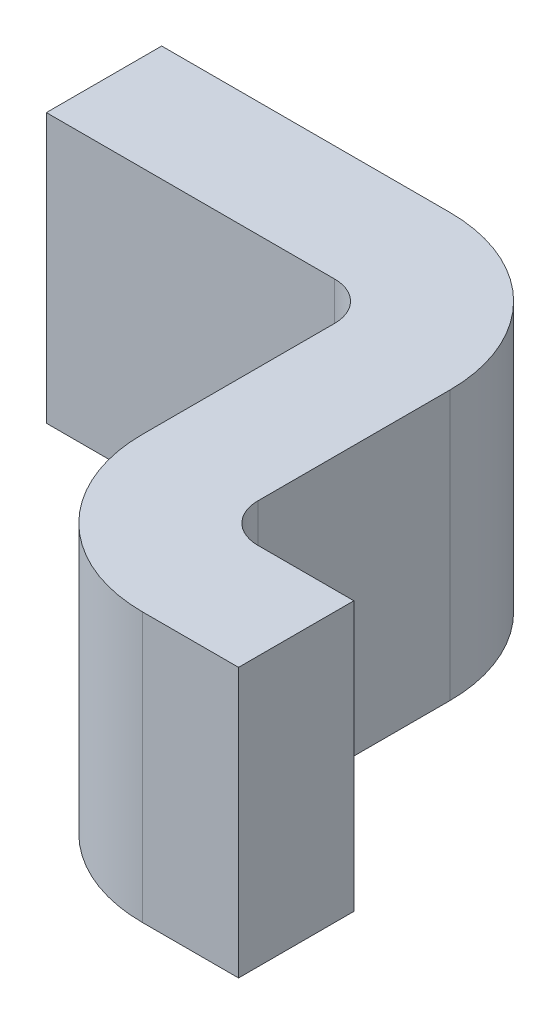
ISO-10303-21;
HEADER;
FILE_DESCRIPTION(('STEP AP214'),'2;1');
FILE_NAME('part.step','',(''),(''),'','','');
FILE_SCHEMA(('AUTOMOTIVE_DESIGN { 1 0 10303 214 1 1 1 1 }'));
ENDSEC;
DATA;
#1=APPLICATION_CONTEXT('core data for automotive mechanical design processes');
#2=APPLICATION_PROTOCOL_DEFINITION('international standard','automotive_design',2000,#1);
#3=PRODUCT_CONTEXT('',#1,'mechanical');
#4=PRODUCT('Part','Part','',(#3));
#5=PRODUCT_RELATED_PRODUCT_CATEGORY('part','',(#4));
#6=PRODUCT_DEFINITION_FORMATION('','',#4);
#7=PRODUCT_DEFINITION_CONTEXT('part definition',#1,'design');
#8=PRODUCT_DEFINITION('design','',#6,#7);
#9=PRODUCT_DEFINITION_SHAPE('','',#8);
#10=(LENGTH_UNIT() NAMED_UNIT(*) SI_UNIT(.MILLI.,.METRE.));
#11=(NAMED_UNIT(*) PLANE_ANGLE_UNIT() SI_UNIT($,.RADIAN.));
#12=(NAMED_UNIT(*) SI_UNIT($,.STERADIAN.) SOLID_ANGLE_UNIT());
#13=UNCERTAINTY_MEASURE_WITH_UNIT(LENGTH_MEASURE(1.E-05),#10,'distance_accuracy_value','');
#14=(GEOMETRIC_REPRESENTATION_CONTEXT(3) GLOBAL_UNCERTAINTY_ASSIGNED_CONTEXT((#13)) GLOBAL_UNIT_ASSIGNED_CONTEXT((#10,
#11,#12)) REPRESENTATION_CONTEXT('',''));
#15=CARTESIAN_POINT('',(0.,0.,0.));
#16=DIRECTION('',(0.,0.,1.));
#17=DIRECTION('',(1.,0.,0.));
#18=AXIS2_PLACEMENT_3D('',#15,#16,#17);
#19=CARTESIAN_POINT('',(-4.075,-2.6082188291665,0.));
#20=DIRECTION('',(0.,-1.,0.));
#21=DIRECTION('',(0.,0.,-1.));
#22=AXIS2_PLACEMENT_3D('',#19,#20,#21);
#23=PLANE('',#22);
#24=DIRECTION('',(-1.,0.,0.));
#25=VECTOR('',#24,1.);
#26=CARTESIAN_POINT('',(0.,-2.6082188291665,0.));
#27=LINE('',#26,#25);
#28=CARTESIAN_POINT('',(-3.75,-2.6082188291665,0.));
#29=VERTEX_POINT('',#28);
#30=CARTESIAN_POINT('',(-4.5,-2.6082188291665,0.));
#31=VERTEX_POINT('',#30);
#32=EDGE_CURVE('E134',#29,#31,#27,.T.);
#33=ORIENTED_EDGE('',*,*,#32,.F.);
#34=CARTESIAN_POINT('',(-3.75,-2.6082188291665,0.4));
#35=DIRECTION('',(0.,1.,0.));
#36=DIRECTION('',(0.,0.,1.));
#37=AXIS2_PLACEMENT_3D('',#34,#35,#36);
#38=CIRCLE('',#37,0.4);
#39=CARTESIAN_POINT('',(-3.35,-2.6082188291665,0.4));
#40=VERTEX_POINT('',#39);
#41=EDGE_CURVE('E182',#40,#29,#38,.T.);
#42=ORIENTED_EDGE('',*,*,#41,.F.);
#43=DIRECTION('',(0.,0.,-1.));
#44=VECTOR('',#43,1.);
#45=CARTESIAN_POINT('',(-3.35,-2.6082188291665,0.));
#46=LINE('',#45,#44);
#47=CARTESIAN_POINT('',(-3.35,-2.6082188291665,0.9));
#48=VERTEX_POINT('',#47);
#49=EDGE_CURVE('E140',#48,#40,#46,.T.);
#50=ORIENTED_EDGE('',*,*,#49,.F.);
#51=CARTESIAN_POINT('',(-3.25,-2.6082188291665,0.9));
#52=DIRECTION('',(0.,-1.,0.));
#53=DIRECTION('',(0.,0.,-1.));
#54=AXIS2_PLACEMENT_3D('',#51,#52,#53);
#55=CIRCLE('',#54,0.1);
#56=CARTESIAN_POINT('',(-3.25,-2.6082188291665,1.));
#57=VERTEX_POINT('',#56);
#58=EDGE_CURVE('E185',#48,#57,#55,.F.);
#59=ORIENTED_EDGE('',*,*,#58,.T.);
#60=DIRECTION('',(1.,0.,0.));
#61=VECTOR('',#60,1.);
#62=CARTESIAN_POINT('',(-3.5,-2.6082188291665,1.));
#63=LINE('',#62,#61);
#64=CARTESIAN_POINT('',(-3.,-2.6082188291665,1.));
#65=VERTEX_POINT('',#64);
#66=EDGE_CURVE('E144',#57,#65,#63,.T.);
#67=ORIENTED_EDGE('',*,*,#66,.T.);
#68=DIRECTION('',(0.,0.,-1.));
#69=VECTOR('',#68,1.);
#70=CARTESIAN_POINT('',(-3.,-2.6082188291665,1.));
#71=LINE('',#70,#69);
#72=CARTESIAN_POINT('',(-3.,-2.6082188291665,1.3));
#73=VERTEX_POINT('',#72);
#74=EDGE_CURVE('E148',#73,#65,#71,.T.);
#75=ORIENTED_EDGE('',*,*,#74,.F.);
#76=DIRECTION('',(1.,0.,0.));
#77=VECTOR('',#76,1.);
#78=CARTESIAN_POINT('',(-3.65,-2.6082188291665,1.3));
#79=LINE('',#78,#77);
#80=CARTESIAN_POINT('',(-3.25,-2.6082188291665,1.3));
#81=VERTEX_POINT('',#80);
#82=EDGE_CURVE('E156',#81,#73,#79,.T.);
#83=ORIENTED_EDGE('',*,*,#82,.F.);
#84=CARTESIAN_POINT('',(-3.25,-2.6082188291665,0.9));
#85=DIRECTION('',(0.,1.,0.));
#86=DIRECTION('',(0.,0.,1.));
#87=AXIS2_PLACEMENT_3D('',#84,#85,#86);
#88=CIRCLE('',#87,0.4);
#89=CARTESIAN_POINT('',(-3.65,-2.6082188291665,0.9));
#90=VERTEX_POINT('',#89);
#91=EDGE_CURVE('E187',#90,#81,#88,.T.);
#92=ORIENTED_EDGE('',*,*,#91,.F.);
#93=DIRECTION('',(0.,0.,-1.));
#94=VECTOR('',#93,1.);
#95=CARTESIAN_POINT('',(-3.65,-2.6082188291665,0.15));
#96=LINE('',#95,#94);
#97=CARTESIAN_POINT('',(-3.65,-2.6082188291665,0.4));
#98=VERTEX_POINT('',#97);
#99=EDGE_CURVE('E162',#90,#98,#96,.T.);
#100=ORIENTED_EDGE('',*,*,#99,.T.);
#101=CARTESIAN_POINT('',(-3.75,-2.6082188291665,0.4));
#102=DIRECTION('',(0.,1.,0.));
#103=DIRECTION('',(0.,0.,1.));
#104=AXIS2_PLACEMENT_3D('',#101,#102,#103);
#105=CIRCLE('',#104,0.1);
#106=CARTESIAN_POINT('',(-3.75,-2.6082188291665,0.3));
#107=VERTEX_POINT('',#106);
#108=EDGE_CURVE('E20',#98,#107,#105,.T.);
#109=ORIENTED_EDGE('',*,*,#108,.T.);
#110=DIRECTION('',(-1.,0.,0.));
#111=VECTOR('',#110,1.);
#112=CARTESIAN_POINT('',(0.,-2.6082188291665,0.3));
#113=LINE('',#112,#111);
#114=CARTESIAN_POINT('',(-4.5,-2.6082188291665,0.3));
#115=VERTEX_POINT('',#114);
#116=EDGE_CURVE('E92',#107,#115,#113,.T.);
#117=ORIENTED_EDGE('',*,*,#116,.T.);
#118=DIRECTION('',(0.,0.,1.));
#119=VECTOR('',#118,1.);
#120=CARTESIAN_POINT('',(-4.5,-2.6082188291665,0.));
#121=LINE('',#120,#119);
#122=EDGE_CURVE('E112',#31,#115,#121,.T.);
#123=ORIENTED_EDGE('',*,*,#122,.F.);
#124=EDGE_LOOP('',(#33,#42,#50,#59,#67,#75,#83,#92,#100,#109,#117,#123));
#125=FACE_BOUND('',#124,.T.);
#126=ADVANCED_FACE('F17',(#125),#23,.T.);
#127=CARTESIAN_POINT('',(0.,-4.5,0.));
#128=DIRECTION('',(0.,0.,-1.));
#129=DIRECTION('',(-1.,0.,0.));
#130=AXIS2_PLACEMENT_3D('',#127,#128,#129);
#131=PLANE('',#130);
#132=DIRECTION('',(0.,1.,0.));
#133=VECTOR('',#132,1.);
#134=CARTESIAN_POINT('',(-4.5,-2.2582188291665,0.));
#135=LINE('',#134,#133);
#136=CARTESIAN_POINT('',(-4.5,-1.9082188291665,0.));
#137=VERTEX_POINT('',#136);
#138=EDGE_CURVE('E101',#137,#31,#135,.F.);
#139=ORIENTED_EDGE('',*,*,#138,.F.);
#140=DIRECTION('',(1.,0.,0.));
#141=VECTOR('',#140,1.);
#142=CARTESIAN_POINT('',(-4.075,-1.9082188291665,0.));
#143=LINE('',#142,#141);
#144=CARTESIAN_POINT('',(-3.75,-1.9082188291665,0.));
#145=VERTEX_POINT('',#144);
#146=EDGE_CURVE('E125',#145,#137,#143,.F.);
#147=ORIENTED_EDGE('',*,*,#146,.F.);
#148=DIRECTION('',(0.,1.,0.));
#149=VECTOR('',#148,1.);
#150=CARTESIAN_POINT('',(-3.75,-4.5,0.));
#151=LINE('',#150,#149);
#152=EDGE_CURVE('E137',#145,#29,#151,.F.);
#153=ORIENTED_EDGE('',*,*,#152,.T.);
#154=ORIENTED_EDGE('',*,*,#32,.T.);
#155=EDGE_LOOP('',(#139,#147,#153,#154));
#156=FACE_BOUND('',#155,.T.);
#157=ADVANCED_FACE('F381',(#156),#131,.T.);
#158=CARTESIAN_POINT('',(-4.5,-2.2582188291665,0.));
#159=DIRECTION('',(-1.,0.,0.));
#160=DIRECTION('',(0.,0.,1.));
#161=AXIS2_PLACEMENT_3D('',#158,#159,#160);
#162=PLANE('',#161);
#163=ORIENTED_EDGE('',*,*,#138,.T.);
#164=ORIENTED_EDGE('',*,*,#122,.T.);
#165=DIRECTION('',(0.,1.,0.));
#166=VECTOR('',#165,1.);
#167=CARTESIAN_POINT('',(-4.5,-4.5,0.3));
#168=LINE('',#167,#166);
#169=CARTESIAN_POINT('',(-4.5,-1.9082188291665,0.3));
#170=VERTEX_POINT('',#169);
#171=EDGE_CURVE('E106',#115,#170,#168,.T.);
#172=ORIENTED_EDGE('',*,*,#171,.T.);
#173=DIRECTION('',(0.,0.,1.));
#174=VECTOR('',#173,1.);
#175=CARTESIAN_POINT('',(-4.5,-1.9082188291665,0.));
#176=LINE('',#175,#174);
#177=EDGE_CURVE('E110',#137,#170,#176,.T.);
#178=ORIENTED_EDGE('',*,*,#177,.F.);
#179=EDGE_LOOP('',(#163,#164,#172,#178));
#180=FACE_BOUND('',#179,.T.);
#181=ADVANCED_FACE('F108',(#180),#162,.T.);
#182=CARTESIAN_POINT('',(0.,-4.5,0.3));
#183=DIRECTION('',(0.,0.,-1.));
#184=DIRECTION('',(-1.,0.,0.));
#185=AXIS2_PLACEMENT_3D('',#182,#183,#184);
#186=PLANE('',#185);
#187=DIRECTION('',(1.,0.,0.));
#188=VECTOR('',#187,1.);
#189=CARTESIAN_POINT('',(-4.075,-1.9082188291665,0.3));
#190=LINE('',#189,#188);
#191=CARTESIAN_POINT('',(-3.75,-1.9082188291665,0.3));
#192=VERTEX_POINT('',#191);
#193=EDGE_CURVE('E117',#170,#192,#190,.T.);
#194=ORIENTED_EDGE('',*,*,#193,.F.);
#195=ORIENTED_EDGE('',*,*,#171,.F.);
#196=ORIENTED_EDGE('',*,*,#116,.F.);
#197=DIRECTION('',(0.,1.,0.));
#198=VECTOR('',#197,1.);
#199=CARTESIAN_POINT('',(-3.75,-3.37910941458325,0.3));
#200=LINE('',#199,#198);
#201=EDGE_CURVE('E114',#107,#192,#200,.T.);
#202=ORIENTED_EDGE('',*,*,#201,.T.);
#203=EDGE_LOOP('',(#194,#195,#196,#202));
#204=FACE_BOUND('',#203,.T.);
#205=ADVANCED_FACE('F118',(#204),#186,.F.);
#206=CARTESIAN_POINT('',(-3.75,-3.37910941458325,0.4));
#207=DIRECTION('',(0.,1.,0.));
#208=DIRECTION('',(0.,0.,1.));
#209=AXIS2_PLACEMENT_3D('',#206,#207,#208);
#210=CYLINDRICAL_SURFACE('',#209,0.1);
#211=ORIENTED_EDGE('',*,*,#108,.F.);
#212=DIRECTION('',(0.,1.,0.));
#213=VECTOR('',#212,1.);
#214=CARTESIAN_POINT('',(-3.65,-2.2582188291665,0.4));
#215=LINE('',#214,#213);
#216=CARTESIAN_POINT('',(-3.65,-1.9082188291665,0.4));
#217=VERTEX_POINT('',#216);
#218=EDGE_CURVE('E164',#98,#217,#215,.T.);
#219=ORIENTED_EDGE('',*,*,#218,.T.);
#220=CARTESIAN_POINT('',(-3.75,-1.9082188291665,0.4));
#221=DIRECTION('',(0.,1.,0.));
#222=DIRECTION('',(0.,0.,1.));
#223=AXIS2_PLACEMENT_3D('',#220,#221,#222);
#224=CIRCLE('',#223,0.1);
#225=EDGE_CURVE('E122',#192,#217,#224,.F.);
#226=ORIENTED_EDGE('',*,*,#225,.F.);
#227=ORIENTED_EDGE('',*,*,#201,.F.);
#228=EDGE_LOOP('',(#211,#219,#226,#227));
#229=FACE_BOUND('',#228,.T.);
#230=ADVANCED_FACE('F262',(#229),#210,.F.);
#231=CARTESIAN_POINT('',(-3.65,-2.2582188291665,0.15));
#232=DIRECTION('',(1.,0.,0.));
#233=DIRECTION('',(0.,0.,-1.));
#234=AXIS2_PLACEMENT_3D('',#231,#232,#233);
#235=PLANE('',#234);
#236=ORIENTED_EDGE('',*,*,#99,.F.);
#237=DIRECTION('',(0.,1.,0.));
#238=VECTOR('',#237,1.);
#239=CARTESIAN_POINT('',(-3.65,-2.2582188291665,0.9));
#240=LINE('',#239,#238);
#241=CARTESIAN_POINT('',(-3.65,-1.9082188291665,0.9));
#242=VERTEX_POINT('',#241);
#243=EDGE_CURVE('E188',#242,#90,#240,.F.);
#244=ORIENTED_EDGE('',*,*,#243,.F.);
#245=DIRECTION('',(0.,0.,1.));
#246=VECTOR('',#245,1.);
#247=CARTESIAN_POINT('',(-3.65,-1.9082188291665,0.));
#248=LINE('',#247,#246);
#249=EDGE_CURVE('E179',#217,#242,#248,.T.);
#250=ORIENTED_EDGE('',*,*,#249,.F.);
#251=ORIENTED_EDGE('',*,*,#218,.F.);
#252=EDGE_LOOP('',(#236,#244,#250,#251));
#253=FACE_BOUND('',#252,.T.);
#254=ADVANCED_FACE('F254',(#253),#235,.F.);
#255=CARTESIAN_POINT('',(-3.25,-2.2582188291665,0.9));
#256=DIRECTION('',(0.,1.,0.));
#257=DIRECTION('',(0.,0.,1.));
#258=AXIS2_PLACEMENT_3D('',#255,#256,#257);
#259=CYLINDRICAL_SURFACE('',#258,0.4);
#260=DIRECTION('',(0.,1.,0.));
#261=VECTOR('',#260,1.);
#262=CARTESIAN_POINT('',(-3.25,-2.2582188291665,1.3));
#263=LINE('',#262,#261);
#264=CARTESIAN_POINT('',(-3.25,-1.9082188291665,1.3));
#265=VERTEX_POINT('',#264);
#266=EDGE_CURVE('E159',#265,#81,#263,.F.);
#267=ORIENTED_EDGE('',*,*,#266,.F.);
#268=CARTESIAN_POINT('',(-3.25,-1.9082188291665,0.9));
#269=DIRECTION('',(0.,1.,0.));
#270=DIRECTION('',(0.,0.,1.));
#271=AXIS2_PLACEMENT_3D('',#268,#269,#270);
#272=CIRCLE('',#271,0.4);
#273=EDGE_CURVE('E176',#242,#265,#272,.T.);
#274=ORIENTED_EDGE('',*,*,#273,.F.);
#275=ORIENTED_EDGE('',*,*,#243,.T.);
#276=ORIENTED_EDGE('',*,*,#91,.T.);
#277=EDGE_LOOP('',(#267,#274,#275,#276));
#278=FACE_BOUND('',#277,.T.);
#279=ADVANCED_FACE('F252',(#278),#259,.T.);
#280=CARTESIAN_POINT('',(-3.65,-2.2582188291665,1.3));
#281=DIRECTION('',(0.,0.,1.));
#282=DIRECTION('',(1.,0.,0.));
#283=AXIS2_PLACEMENT_3D('',#280,#281,#282);
#284=PLANE('',#283);
#285=DIRECTION('',(0.,1.,0.));
#286=VECTOR('',#285,1.);
#287=CARTESIAN_POINT('',(-3.,-2.2582188291665,1.3));
#288=LINE('',#287,#286);
#289=CARTESIAN_POINT('',(-3.,-1.9082188291665,1.3));
#290=VERTEX_POINT('',#289);
#291=EDGE_CURVE('E153',#290,#73,#288,.F.);
#292=ORIENTED_EDGE('',*,*,#291,.F.);
#293=DIRECTION('',(1.,0.,0.));
#294=VECTOR('',#293,1.);
#295=CARTESIAN_POINT('',(-4.075,-1.9082188291665,1.3));
#296=LINE('',#295,#294);
#297=EDGE_CURVE('E178',#265,#290,#296,.T.);
#298=ORIENTED_EDGE('',*,*,#297,.F.);
#299=ORIENTED_EDGE('',*,*,#266,.T.);
#300=ORIENTED_EDGE('',*,*,#82,.T.);
#301=EDGE_LOOP('',(#292,#298,#299,#300));
#302=FACE_BOUND('',#301,.T.);
#303=ADVANCED_FACE('F247',(#302),#284,.T.);
#304=CARTESIAN_POINT('',(-3.,-2.2582188291665,1.));
#305=DIRECTION('',(1.,0.,0.));
#306=DIRECTION('',(0.,0.,-1.));
#307=AXIS2_PLACEMENT_3D('',#304,#305,#306);
#308=PLANE('',#307);
#309=DIRECTION('',(0.,1.,0.));
#310=VECTOR('',#309,1.);
#311=CARTESIAN_POINT('',(-3.,-2.2582188291665,1.));
#312=LINE('',#311,#310);
#313=CARTESIAN_POINT('',(-3.,-1.9082188291665,1.));
#314=VERTEX_POINT('',#313);
#315=EDGE_CURVE('E147',#65,#314,#312,.T.);
#316=ORIENTED_EDGE('',*,*,#315,.T.);
#317=DIRECTION('',(0.,0.,1.));
#318=VECTOR('',#317,1.);
#319=CARTESIAN_POINT('',(-3.,-1.9082188291665,0.));
#320=LINE('',#319,#318);
#321=EDGE_CURVE('E207',#290,#314,#320,.F.);
#322=ORIENTED_EDGE('',*,*,#321,.F.);
#323=ORIENTED_EDGE('',*,*,#291,.T.);
#324=ORIENTED_EDGE('',*,*,#74,.T.);
#325=EDGE_LOOP('',(#316,#322,#323,#324));
#326=FACE_BOUND('',#325,.T.);
#327=ADVANCED_FACE('F250',(#326),#308,.T.);
#328=CARTESIAN_POINT('',(-3.5,-2.2582188291665,1.));
#329=DIRECTION('',(0.,0.,1.));
#330=DIRECTION('',(1.,0.,0.));
#331=AXIS2_PLACEMENT_3D('',#328,#329,#330);
#332=PLANE('',#331);
#333=DIRECTION('',(1.,0.,0.));
#334=VECTOR('',#333,1.);
#335=CARTESIAN_POINT('',(-4.075,-1.9082188291665,1.));
#336=LINE('',#335,#334);
#337=CARTESIAN_POINT('',(-3.25,-1.9082188291665,1.));
#338=VERTEX_POINT('',#337);
#339=EDGE_CURVE('E175',#314,#338,#336,.F.);
#340=ORIENTED_EDGE('',*,*,#339,.F.);
#341=ORIENTED_EDGE('',*,*,#315,.F.);
#342=ORIENTED_EDGE('',*,*,#66,.F.);
#343=DIRECTION('',(0.,-1.,0.));
#344=VECTOR('',#343,1.);
#345=CARTESIAN_POINT('',(-3.25,-2.2582188291665,1.));
#346=LINE('',#345,#344);
#347=EDGE_CURVE('E186',#57,#338,#346,.F.);
#348=ORIENTED_EDGE('',*,*,#347,.T.);
#349=EDGE_LOOP('',(#340,#341,#342,#348));
#350=FACE_BOUND('',#349,.T.);
#351=ADVANCED_FACE('F237',(#350),#332,.F.);
#352=CARTESIAN_POINT('',(-3.25,-2.2582188291665,0.9));
#353=DIRECTION('',(0.,-1.,0.));
#354=DIRECTION('',(0.,0.,-1.));
#355=AXIS2_PLACEMENT_3D('',#352,#353,#354);
#356=CYLINDRICAL_SURFACE('',#355,0.1);
#357=ORIENTED_EDGE('',*,*,#58,.F.);
#358=DIRECTION('',(0.,1.,0.));
#359=VECTOR('',#358,1.);
#360=CARTESIAN_POINT('',(-3.35,-2.2582188291665,0.9));
#361=LINE('',#360,#359);
#362=CARTESIAN_POINT('',(-3.35,-1.9082188291665,0.9));
#363=VERTEX_POINT('',#362);
#364=EDGE_CURVE('E143',#363,#48,#361,.F.);
#365=ORIENTED_EDGE('',*,*,#364,.F.);
#366=CARTESIAN_POINT('',(-3.25,-1.9082188291665,0.9));
#367=DIRECTION('',(0.,-1.,0.));
#368=DIRECTION('',(0.,0.,-1.));
#369=AXIS2_PLACEMENT_3D('',#366,#367,#368);
#370=CIRCLE('',#369,0.1);
#371=EDGE_CURVE('E26',#338,#363,#370,.T.);
#372=ORIENTED_EDGE('',*,*,#371,.F.);
#373=ORIENTED_EDGE('',*,*,#347,.F.);
#374=EDGE_LOOP('',(#357,#365,#372,#373));
#375=FACE_BOUND('',#374,.T.);
#376=ADVANCED_FACE('F276',(#375),#356,.F.);
#377=CARTESIAN_POINT('',(-3.35,-2.2582188291665,0.));
#378=DIRECTION('',(1.,0.,0.));
#379=DIRECTION('',(0.,0.,-1.));
#380=AXIS2_PLACEMENT_3D('',#377,#378,#379);
#381=PLANE('',#380);
#382=ORIENTED_EDGE('',*,*,#364,.T.);
#383=ORIENTED_EDGE('',*,*,#49,.T.);
#384=DIRECTION('',(0.,1.,0.));
#385=VECTOR('',#384,1.);
#386=CARTESIAN_POINT('',(-3.35,-3.37910941458325,0.4));
#387=LINE('',#386,#385);
#388=CARTESIAN_POINT('',(-3.35,-1.9082188291665,0.4));
#389=VERTEX_POINT('',#388);
#390=EDGE_CURVE('E142',#389,#40,#387,.F.);
#391=ORIENTED_EDGE('',*,*,#390,.F.);
#392=DIRECTION('',(0.,0.,1.));
#393=VECTOR('',#392,1.);
#394=CARTESIAN_POINT('',(-3.35,-1.9082188291665,0.));
#395=LINE('',#394,#393);
#396=EDGE_CURVE('E11',#363,#389,#395,.F.);
#397=ORIENTED_EDGE('',*,*,#396,.F.);
#398=EDGE_LOOP('',(#382,#383,#391,#397));
#399=FACE_BOUND('',#398,.T.);
#400=ADVANCED_FACE('F271',(#399),#381,.T.);
#401=CARTESIAN_POINT('',(-3.75,-3.37910941458325,0.4));
#402=DIRECTION('',(0.,1.,0.));
#403=DIRECTION('',(0.,0.,1.));
#404=AXIS2_PLACEMENT_3D('',#401,#402,#403);
#405=CYLINDRICAL_SURFACE('',#404,0.4);
#406=ORIENTED_EDGE('',*,*,#390,.T.);
#407=ORIENTED_EDGE('',*,*,#41,.T.);
#408=ORIENTED_EDGE('',*,*,#152,.F.);
#409=CARTESIAN_POINT('',(-3.75,-1.9082188291665,0.4));
#410=DIRECTION('',(0.,1.,0.));
#411=DIRECTION('',(0.,0.,1.));
#412=AXIS2_PLACEMENT_3D('',#409,#410,#411);
#413=CIRCLE('',#412,0.4);
#414=EDGE_CURVE('E35',#389,#145,#413,.T.);
#415=ORIENTED_EDGE('',*,*,#414,.F.);
#416=EDGE_LOOP('',(#406,#407,#408,#415));
#417=FACE_BOUND('',#416,.T.);
#418=ADVANCED_FACE('F266',(#417),#405,.T.);
#419=CARTESIAN_POINT('',(-4.075,-1.9082188291665,0.));
#420=DIRECTION('',(0.,1.,0.));
#421=DIRECTION('',(0.,0.,1.));
#422=AXIS2_PLACEMENT_3D('',#419,#420,#421);
#423=PLANE('',#422);
#424=ORIENTED_EDGE('',*,*,#396,.T.);
#425=ORIENTED_EDGE('',*,*,#414,.T.);
#426=ORIENTED_EDGE('',*,*,#146,.T.);
#427=ORIENTED_EDGE('',*,*,#177,.T.);
#428=ORIENTED_EDGE('',*,*,#193,.T.);
#429=ORIENTED_EDGE('',*,*,#225,.T.);
#430=ORIENTED_EDGE('',*,*,#249,.T.);
#431=ORIENTED_EDGE('',*,*,#273,.T.);
#432=ORIENTED_EDGE('',*,*,#297,.T.);
#433=ORIENTED_EDGE('',*,*,#321,.T.);
#434=ORIENTED_EDGE('',*,*,#339,.T.);
#435=ORIENTED_EDGE('',*,*,#371,.T.);
#436=EDGE_LOOP('',(#424,#425,#426,#427,#428,#429,#430,#431,#432,#433,#434,#435));
#437=FACE_BOUND('',#436,.T.);
#438=ADVANCED_FACE('F124',(#437),#423,.T.);
#439=CLOSED_SHELL('',(#126,#157,#181,#205,#230,#254,#279,#303,#327,#351,#376,#400,#418,#438));
#440=MANIFOLD_SOLID_BREP('B1',#439);
#441=ADVANCED_BREP_SHAPE_REPRESENTATION('',(#18,#440),#14);
#442=SHAPE_DEFINITION_REPRESENTATION(#9,#441);
ENDSEC;
END-ISO-10303-21;
